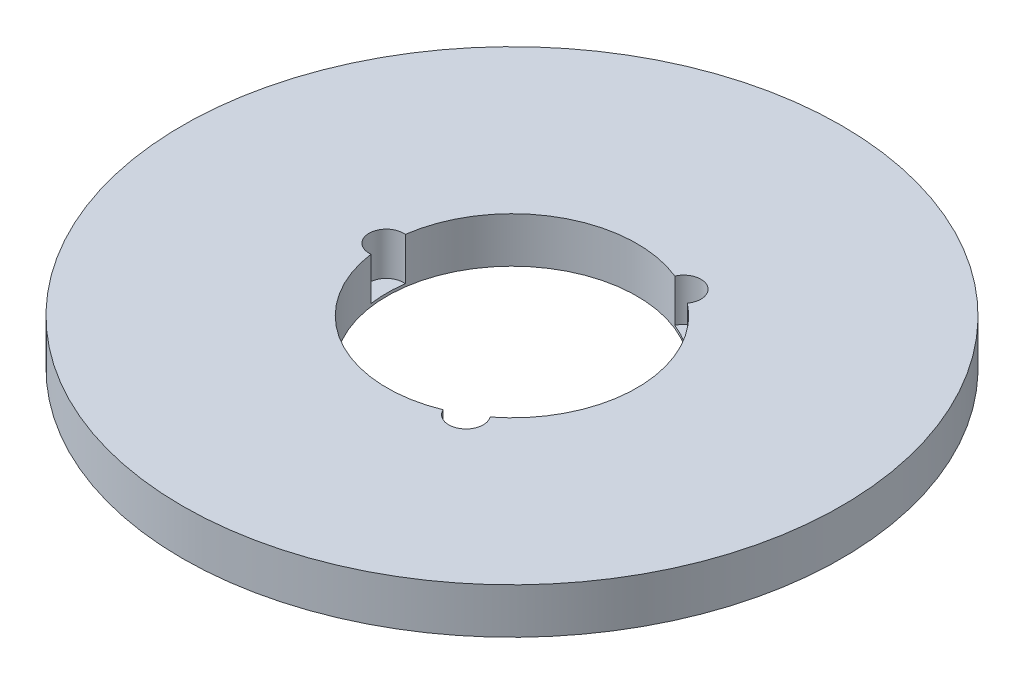
ISO-10303-21;
HEADER;
FILE_DESCRIPTION(('STEP AP214'),'2;1');
FILE_NAME('part.step','',(''),(''),'','','');
FILE_SCHEMA(('AUTOMOTIVE_DESIGN { 1 0 10303 214 1 1 1 1 }'));
ENDSEC;
DATA;
#1=APPLICATION_CONTEXT('core data for automotive mechanical design processes');
#2=APPLICATION_PROTOCOL_DEFINITION('international standard','automotive_design',2000,#1);
#3=PRODUCT_CONTEXT('',#1,'mechanical');
#4=PRODUCT('Part','Part','',(#3));
#5=PRODUCT_RELATED_PRODUCT_CATEGORY('part','',(#4));
#6=PRODUCT_DEFINITION_FORMATION('','',#4);
#7=PRODUCT_DEFINITION_CONTEXT('part definition',#1,'design');
#8=PRODUCT_DEFINITION('design','',#6,#7);
#9=PRODUCT_DEFINITION_SHAPE('','',#8);
#10=(LENGTH_UNIT() NAMED_UNIT(*) SI_UNIT(.MILLI.,.METRE.));
#11=(NAMED_UNIT(*) PLANE_ANGLE_UNIT() SI_UNIT($,.RADIAN.));
#12=(NAMED_UNIT(*) SI_UNIT($,.STERADIAN.) SOLID_ANGLE_UNIT());
#13=UNCERTAINTY_MEASURE_WITH_UNIT(LENGTH_MEASURE(1.E-05),#10,'distance_accuracy_value','');
#14=(GEOMETRIC_REPRESENTATION_CONTEXT(3) GLOBAL_UNCERTAINTY_ASSIGNED_CONTEXT((#13)) GLOBAL_UNIT_ASSIGNED_CONTEXT((#10,
#11,#12)) REPRESENTATION_CONTEXT('',''));
#15=CARTESIAN_POINT('',(0.,0.,0.));
#16=DIRECTION('',(0.,0.,1.));
#17=DIRECTION('',(1.,0.,0.));
#18=AXIS2_PLACEMENT_3D('',#15,#16,#17);
#19=CARTESIAN_POINT('',(0.,10.,0.));
#20=DIRECTION('',(0.,-1.,0.));
#21=DIRECTION('',(0.,0.,-1.));
#22=AXIS2_PLACEMENT_3D('',#19,#20,#21);
#23=CYLINDRICAL_SURFACE('',#22,72.5);
#24=CARTESIAN_POINT('',(0.,10.,0.));
#25=DIRECTION('',(0.,1.,0.));
#26=DIRECTION('',(0.,0.,1.));
#27=AXIS2_PLACEMENT_3D('',#24,#25,#26);
#28=CIRCLE('',#27,72.5);
#29=CARTESIAN_POINT('',(0.,10.,72.5));
#30=VERTEX_POINT('',#29);
#31=EDGE_CURVE('E126',#30,#30,#28,.T.);
#32=ORIENTED_EDGE('',*,*,#31,.F.);
#33=EDGE_LOOP('',(#32));
#34=FACE_BOUND('',#33,.T.);
#35=CARTESIAN_POINT('',(0.,0.,0.));
#36=DIRECTION('',(0.,1.,0.));
#37=DIRECTION('',(0.,0.,1.));
#38=AXIS2_PLACEMENT_3D('',#35,#36,#37);
#39=CIRCLE('',#38,72.5);
#40=CARTESIAN_POINT('',(0.,0.,72.5));
#41=VERTEX_POINT('',#40);
#42=EDGE_CURVE('E124',#41,#41,#39,.T.);
#43=ORIENTED_EDGE('',*,*,#42,.T.);
#44=EDGE_LOOP('',(#43));
#45=FACE_BOUND('',#44,.T.);
#46=ADVANCED_FACE('F39',(#34,#45),#23,.T.);
#47=CARTESIAN_POINT('',(0.,10.,0.));
#48=DIRECTION('',(0.,1.,0.));
#49=DIRECTION('',(0.,0.,1.));
#50=AXIS2_PLACEMENT_3D('',#47,#48,#49);
#51=PLANE('',#50);
#52=CARTESIAN_POINT('',(13.8215293410402,10.,23.9395910569853));
#53=DIRECTION('',(0.,1.,0.));
#54=DIRECTION('',(0.866025403784436,0.,-0.500000000000004));
#55=AXIS2_PLACEMENT_3D('',#52,#53,#54);
#56=CIRCLE('',#55,3.80207179841751);
#57=CARTESIAN_POINT('',(10.3454145544478,10.,25.4798429684451));
#58=VERTEX_POINT('',#57);
#59=CARTESIAN_POINT('',(16.893484017888,10.,21.6993133010554));
#60=VERTEX_POINT('',#59);
#61=EDGE_CURVE('E147',#58,#60,#56,.T.);
#62=ORIENTED_EDGE('',*,*,#61,.F.);
#63=CARTESIAN_POINT('',(0.,10.,0.));
#64=DIRECTION('',(0.,1.,0.));
#65=DIRECTION('',(0.,0.,1.));
#66=AXIS2_PLACEMENT_3D('',#63,#64,#65);
#67=CIRCLE('',#66,27.5);
#68=CARTESIAN_POINT('',(-27.2388985723356,10.,3.78052966738962));
#69=VERTEX_POINT('',#68);
#70=EDGE_CURVE('E118',#69,#58,#67,.T.);
#71=ORIENTED_EDGE('',*,*,#70,.F.);
#72=CARTESIAN_POINT('',(-27.6430586820801,10.,0.));
#73=DIRECTION('',(0.,1.,0.));
#74=DIRECTION('',(0.,0.,1.));
#75=AXIS2_PLACEMENT_3D('',#72,#73,#74);
#76=CIRCLE('',#75,3.80207179841751);
#77=CARTESIAN_POINT('',(-27.2388985723356,10.,-3.78052966738962));
#78=VERTEX_POINT('',#77);
#79=EDGE_CURVE('E113',#78,#69,#76,.T.);
#80=ORIENTED_EDGE('',*,*,#79,.F.);
#81=CARTESIAN_POINT('',(10.3454145544474,10.,-25.4798429684452));
#82=VERTEX_POINT('',#81);
#83=EDGE_CURVE('E106',#82,#78,#67,.T.);
#84=ORIENTED_EDGE('',*,*,#83,.F.);
#85=CARTESIAN_POINT('',(13.8215293410398,10.,-23.9395910569855));
#86=DIRECTION('',(0.,1.,0.));
#87=DIRECTION('',(-0.866025403784443,0.,-0.499999999999992));
#88=AXIS2_PLACEMENT_3D('',#85,#86,#87);
#89=CIRCLE('',#88,3.80207179841751);
#90=CARTESIAN_POINT('',(16.8934840178877,10.,-21.6993133010557));
#91=VERTEX_POINT('',#90);
#92=EDGE_CURVE('E90',#91,#82,#89,.T.);
#93=ORIENTED_EDGE('',*,*,#92,.F.);
#94=EDGE_CURVE('E116',#60,#91,#67,.T.);
#95=ORIENTED_EDGE('',*,*,#94,.F.);
#96=EDGE_LOOP('',(#62,#71,#80,#84,#93,#95));
#97=FACE_BOUND('',#96,.T.);
#98=ORIENTED_EDGE('',*,*,#31,.T.);
#99=EDGE_LOOP('',(#98));
#100=FACE_BOUND('',#99,.T.);
#101=ADVANCED_FACE('F115',(#97,#100),#51,.T.);
#102=CARTESIAN_POINT('',(0.,0.,0.));
#103=DIRECTION('',(0.,1.,0.));
#104=DIRECTION('',(0.,0.,1.));
#105=AXIS2_PLACEMENT_3D('',#102,#103,#104);
#106=PLANE('',#105);
#107=CARTESIAN_POINT('',(0.,0.,0.));
#108=DIRECTION('',(0.,1.,0.));
#109=DIRECTION('',(0.,0.,1.));
#110=AXIS2_PLACEMENT_3D('',#107,#108,#109);
#111=CIRCLE('',#110,27.5);
#112=CARTESIAN_POINT('',(0.,0.,27.5));
#113=VERTEX_POINT('',#112);
#114=EDGE_CURVE('E120',#113,#113,#111,.T.);
#115=ORIENTED_EDGE('',*,*,#114,.T.);
#116=EDGE_LOOP('',(#115));
#117=FACE_BOUND('',#116,.T.);
#118=ORIENTED_EDGE('',*,*,#42,.F.);
#119=EDGE_LOOP('',(#118));
#120=FACE_BOUND('',#119,.T.);
#121=ADVANCED_FACE('F164',(#117,#120),#106,.F.);
#122=CARTESIAN_POINT('',(0.,10.,0.));
#123=DIRECTION('',(0.,-1.,0.));
#124=DIRECTION('',(0.,0.,-1.));
#125=AXIS2_PLACEMENT_3D('',#122,#123,#124);
#126=CYLINDRICAL_SURFACE('',#125,27.5);
#127=DIRECTION('',(0.,1.,0.));
#128=VECTOR('',#127,1.);
#129=CARTESIAN_POINT('',(10.3454145544478,5.30246742335482,25.4798429684451));
#130=LINE('',#129,#128);
#131=CARTESIAN_POINT('',(10.3454145544478,0.604934846709646,25.4798429684451));
#132=VERTEX_POINT('',#131);
#133=EDGE_CURVE('E11',#132,#58,#130,.T.);
#134=ORIENTED_EDGE('',*,*,#133,.F.);
#135=CARTESIAN_POINT('',(0.,0.604934846709646,0.));
#136=DIRECTION('',(0.,1.,0.));
#137=DIRECTION('',(0.,0.,1.));
#138=AXIS2_PLACEMENT_3D('',#135,#136,#137);
#139=CIRCLE('',#138,27.5);
#140=CARTESIAN_POINT('',(16.893484017888,0.604934846709646,21.6993133010554));
#141=VERTEX_POINT('',#140);
#142=EDGE_CURVE('E144',#132,#141,#139,.T.);
#143=ORIENTED_EDGE('',*,*,#142,.T.);
#144=DIRECTION('',(0.,1.,0.));
#145=VECTOR('',#144,1.);
#146=CARTESIAN_POINT('',(16.893484017888,5.30246742335482,21.6993133010554));
#147=LINE('',#146,#145);
#148=EDGE_CURVE('E46',#60,#141,#147,.F.);
#149=ORIENTED_EDGE('',*,*,#148,.F.);
#150=ORIENTED_EDGE('',*,*,#94,.T.);
#151=DIRECTION('',(0.,1.,0.));
#152=VECTOR('',#151,1.);
#153=CARTESIAN_POINT('',(16.8934840178877,5.30246742335482,-21.6993133010557));
#154=LINE('',#153,#152);
#155=CARTESIAN_POINT('',(16.8934840178877,0.604934846709646,-21.6993133010557));
#156=VERTEX_POINT('',#155);
#157=EDGE_CURVE('E92',#156,#91,#154,.T.);
#158=ORIENTED_EDGE('',*,*,#157,.F.);
#159=CARTESIAN_POINT('',(0.,0.604934846709646,0.));
#160=DIRECTION('',(0.,1.,0.));
#161=DIRECTION('',(0.,0.,1.));
#162=AXIS2_PLACEMENT_3D('',#159,#160,#161);
#163=CIRCLE('',#162,27.5);
#164=CARTESIAN_POINT('',(10.3454145544474,0.604934846709646,-25.4798429684452));
#165=VERTEX_POINT('',#164);
#166=EDGE_CURVE('E107',#156,#165,#163,.T.);
#167=ORIENTED_EDGE('',*,*,#166,.T.);
#168=DIRECTION('',(0.,1.,0.));
#169=VECTOR('',#168,1.);
#170=CARTESIAN_POINT('',(10.3454145544474,5.30246742335482,-25.4798429684452));
#171=LINE('',#170,#169);
#172=EDGE_CURVE('E95',#82,#165,#171,.F.);
#173=ORIENTED_EDGE('',*,*,#172,.F.);
#174=ORIENTED_EDGE('',*,*,#83,.T.);
#175=DIRECTION('',(0.,1.,0.));
#176=VECTOR('',#175,1.);
#177=CARTESIAN_POINT('',(-27.2388985723356,5.30246742335482,-3.78052966738962));
#178=LINE('',#177,#176);
#179=CARTESIAN_POINT('',(-27.2388985723356,0.604934846709646,-3.78052966738962));
#180=VERTEX_POINT('',#179);
#181=EDGE_CURVE('E143',#180,#78,#178,.T.);
#182=ORIENTED_EDGE('',*,*,#181,.F.);
#183=CARTESIAN_POINT('',(0.,0.604934846709646,0.));
#184=DIRECTION('',(0.,1.,0.));
#185=DIRECTION('',(0.,0.,1.));
#186=AXIS2_PLACEMENT_3D('',#183,#184,#185);
#187=CIRCLE('',#186,27.5);
#188=CARTESIAN_POINT('',(-27.2388985723356,0.604934846709646,3.78052966738962));
#189=VERTEX_POINT('',#188);
#190=EDGE_CURVE('E132',#180,#189,#187,.T.);
#191=ORIENTED_EDGE('',*,*,#190,.T.);
#192=DIRECTION('',(0.,1.,0.));
#193=VECTOR('',#192,1.);
#194=CARTESIAN_POINT('',(-27.2388985723356,5.30246742335482,3.78052966738962));
#195=LINE('',#194,#193);
#196=EDGE_CURVE('E137',#69,#189,#195,.F.);
#197=ORIENTED_EDGE('',*,*,#196,.F.);
#198=ORIENTED_EDGE('',*,*,#70,.T.);
#199=EDGE_LOOP('',(#134,#143,#149,#150,#158,#167,#173,#174,#182,#191,#197,#198));
#200=FACE_BOUND('',#199,.T.);
#201=ORIENTED_EDGE('',*,*,#114,.F.);
#202=EDGE_LOOP('',(#201));
#203=FACE_BOUND('',#202,.T.);
#204=ADVANCED_FACE('F103',(#200,#203),#126,.F.);
#205=CARTESIAN_POINT('',(-27.6430586820801,0.604934846709646,0.));
#206=DIRECTION('',(0.,1.,0.));
#207=DIRECTION('',(0.,0.,1.));
#208=AXIS2_PLACEMENT_3D('',#205,#206,#207);
#209=CYLINDRICAL_SURFACE('',#208,3.80207179841751);
#210=ORIENTED_EDGE('',*,*,#181,.T.);
#211=ORIENTED_EDGE('',*,*,#79,.T.);
#212=ORIENTED_EDGE('',*,*,#196,.T.);
#213=CARTESIAN_POINT('',(-27.6430586820801,0.604934846709646,0.));
#214=DIRECTION('',(0.,1.,0.));
#215=DIRECTION('',(0.,0.,1.));
#216=AXIS2_PLACEMENT_3D('',#213,#214,#215);
#217=CIRCLE('',#216,3.80207179841751);
#218=EDGE_CURVE('E121',#180,#189,#217,.T.);
#219=ORIENTED_EDGE('',*,*,#218,.F.);
#220=EDGE_LOOP('',(#210,#211,#212,#219));
#221=FACE_BOUND('',#220,.T.);
#222=ADVANCED_FACE('F174',(#221),#209,.F.);
#223=CARTESIAN_POINT('',(-27.6430586820801,0.604934846709646,0.));
#224=DIRECTION('',(0.,1.,0.));
#225=DIRECTION('',(0.,0.,1.));
#226=AXIS2_PLACEMENT_3D('',#223,#224,#225);
#227=PLANE('',#226);
#228=ORIENTED_EDGE('',*,*,#218,.T.);
#229=ORIENTED_EDGE('',*,*,#190,.F.);
#230=EDGE_LOOP('',(#228,#229));
#231=FACE_BOUND('',#230,.T.);
#232=ADVANCED_FACE('F177',(#231),#227,.T.);
#233=CARTESIAN_POINT('',(13.8215293410398,0.604934846709646,-23.9395910569855));
#234=DIRECTION('',(0.,1.,0.));
#235=DIRECTION('',(0.,0.,1.));
#236=AXIS2_PLACEMENT_3D('',#233,#234,#235);
#237=CYLINDRICAL_SURFACE('',#236,3.80207179841751);
#238=ORIENTED_EDGE('',*,*,#157,.T.);
#239=ORIENTED_EDGE('',*,*,#92,.T.);
#240=ORIENTED_EDGE('',*,*,#172,.T.);
#241=CARTESIAN_POINT('',(13.8215293410398,0.604934846709646,-23.9395910569855));
#242=DIRECTION('',(0.,1.,0.));
#243=DIRECTION('',(-0.866025403784443,0.,-0.499999999999992));
#244=AXIS2_PLACEMENT_3D('',#241,#242,#243);
#245=CIRCLE('',#244,3.80207179841751);
#246=EDGE_CURVE('E56',#156,#165,#245,.T.);
#247=ORIENTED_EDGE('',*,*,#246,.F.);
#248=EDGE_LOOP('',(#238,#239,#240,#247));
#249=FACE_BOUND('',#248,.T.);
#250=ADVANCED_FACE('F93',(#249),#237,.F.);
#251=CARTESIAN_POINT('',(13.8215293410398,0.604934846709646,-23.9395910569855));
#252=DIRECTION('',(0.,1.,0.));
#253=DIRECTION('',(-0.866025403784443,0.,-0.499999999999992));
#254=AXIS2_PLACEMENT_3D('',#251,#252,#253);
#255=PLANE('',#254);
#256=ORIENTED_EDGE('',*,*,#246,.T.);
#257=ORIENTED_EDGE('',*,*,#166,.F.);
#258=EDGE_LOOP('',(#256,#257));
#259=FACE_BOUND('',#258,.T.);
#260=ADVANCED_FACE('F160',(#259),#255,.T.);
#261=CARTESIAN_POINT('',(13.8215293410402,0.604934846709646,23.9395910569853));
#262=DIRECTION('',(0.,1.,0.));
#263=DIRECTION('',(0.,0.,1.));
#264=AXIS2_PLACEMENT_3D('',#261,#262,#263);
#265=CYLINDRICAL_SURFACE('',#264,3.80207179841751);
#266=ORIENTED_EDGE('',*,*,#133,.T.);
#267=ORIENTED_EDGE('',*,*,#61,.T.);
#268=ORIENTED_EDGE('',*,*,#148,.T.);
#269=CARTESIAN_POINT('',(13.8215293410402,0.604934846709646,23.9395910569853));
#270=DIRECTION('',(0.,1.,0.));
#271=DIRECTION('',(0.866025403784436,0.,-0.500000000000004));
#272=AXIS2_PLACEMENT_3D('',#269,#270,#271);
#273=CIRCLE('',#272,3.80207179841751);
#274=EDGE_CURVE('E55',#132,#141,#273,.T.);
#275=ORIENTED_EDGE('',*,*,#274,.F.);
#276=EDGE_LOOP('',(#266,#267,#268,#275));
#277=FACE_BOUND('',#276,.T.);
#278=ADVANCED_FACE('F149',(#277),#265,.F.);
#279=CARTESIAN_POINT('',(13.8215293410402,0.604934846709646,23.9395910569853));
#280=DIRECTION('',(0.,1.,0.));
#281=DIRECTION('',(0.866025403784436,0.,-0.500000000000004));
#282=AXIS2_PLACEMENT_3D('',#279,#280,#281);
#283=PLANE('',#282);
#284=ORIENTED_EDGE('',*,*,#274,.T.);
#285=ORIENTED_EDGE('',*,*,#142,.F.);
#286=EDGE_LOOP('',(#284,#285));
#287=FACE_BOUND('',#286,.T.);
#288=ADVANCED_FACE('F151',(#287),#283,.T.);
#289=CLOSED_SHELL('',(#46,#101,#121,#204,#222,#232,#250,#260,#278,#288));
#290=MANIFOLD_SOLID_BREP('B2',#289);
#291=ADVANCED_BREP_SHAPE_REPRESENTATION('',(#18,#290),#14);
#292=SHAPE_DEFINITION_REPRESENTATION(#9,#291);
ENDSEC;
END-ISO-10303-21;
